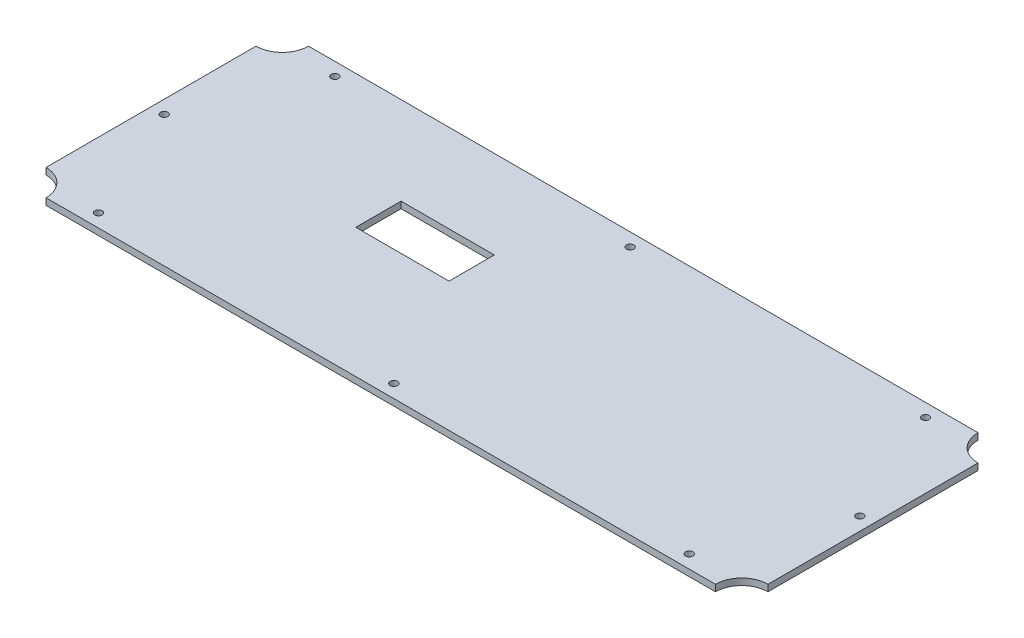
ISO-10303-21;
HEADER;
FILE_DESCRIPTION(('STEP AP214'),'2;1');
FILE_NAME('part.step','',(''),(''),'','','');
FILE_SCHEMA(('AUTOMOTIVE_DESIGN { 1 0 10303 214 1 1 1 1 }'));
ENDSEC;
DATA;
#1=APPLICATION_CONTEXT('core data for automotive mechanical design processes');
#2=APPLICATION_PROTOCOL_DEFINITION('international standard','automotive_design',2000,#1);
#3=PRODUCT_CONTEXT('',#1,'mechanical');
#4=PRODUCT('Part','Part','',(#3));
#5=PRODUCT_RELATED_PRODUCT_CATEGORY('part','',(#4));
#6=PRODUCT_DEFINITION_FORMATION('','',#4);
#7=PRODUCT_DEFINITION_CONTEXT('part definition',#1,'design');
#8=PRODUCT_DEFINITION('design','',#6,#7);
#9=PRODUCT_DEFINITION_SHAPE('','',#8);
#10=(LENGTH_UNIT() NAMED_UNIT(*) SI_UNIT(.MILLI.,.METRE.));
#11=(NAMED_UNIT(*) PLANE_ANGLE_UNIT() SI_UNIT($,.RADIAN.));
#12=(NAMED_UNIT(*) SI_UNIT($,.STERADIAN.) SOLID_ANGLE_UNIT());
#13=UNCERTAINTY_MEASURE_WITH_UNIT(LENGTH_MEASURE(1.E-05),#10,'distance_accuracy_value','');
#14=(GEOMETRIC_REPRESENTATION_CONTEXT(3) GLOBAL_UNCERTAINTY_ASSIGNED_CONTEXT((#13)) GLOBAL_UNIT_ASSIGNED_CONTEXT((#10,
#11,#12)) REPRESENTATION_CONTEXT('',''));
#15=CARTESIAN_POINT('',(0.,0.,0.));
#16=DIRECTION('',(0.,0.,1.));
#17=DIRECTION('',(1.,0.,0.));
#18=AXIS2_PLACEMENT_3D('',#15,#16,#17);
#19=CARTESIAN_POINT('',(-139.7,-5.08,-50.8));
#20=DIRECTION('',(-1.,0.,0.));
#21=DIRECTION('',(0.,0.,1.));
#22=AXIS2_PLACEMENT_3D('',#19,#20,#21);
#23=PLANE('',#22);
#24=DIRECTION('',(0.,1.,0.));
#25=VECTOR('',#24,1.);
#26=CARTESIAN_POINT('',(-139.7,-7.62,-40.64));
#27=LINE('',#26,#25);
#28=CARTESIAN_POINT('',(-139.7,0.,-40.64));
#29=VERTEX_POINT('',#28);
#30=CARTESIAN_POINT('',(-139.7,-2.54,-40.64));
#31=VERTEX_POINT('',#30);
#32=EDGE_CURVE('E159',#29,#31,#27,.F.);
#33=ORIENTED_EDGE('',*,*,#32,.T.);
#34=DIRECTION('',(0.,0.,1.));
#35=VECTOR('',#34,1.);
#36=CARTESIAN_POINT('',(-139.7,-2.54,-50.8));
#37=LINE('',#36,#35);
#38=CARTESIAN_POINT('',(-139.7,-2.54,40.64));
#39=VERTEX_POINT('',#38);
#40=EDGE_CURVE('E55',#31,#39,#37,.T.);
#41=ORIENTED_EDGE('',*,*,#40,.T.);
#42=DIRECTION('',(0.,1.,0.));
#43=VECTOR('',#42,1.);
#44=CARTESIAN_POINT('',(-139.7,-7.62,40.64));
#45=LINE('',#44,#43);
#46=CARTESIAN_POINT('',(-139.7,0.,40.64));
#47=VERTEX_POINT('',#46);
#48=EDGE_CURVE('E182',#47,#39,#45,.F.);
#49=ORIENTED_EDGE('',*,*,#48,.F.);
#50=DIRECTION('',(0.,0.,1.));
#51=VECTOR('',#50,1.);
#52=CARTESIAN_POINT('',(-139.7,0.,-50.8));
#53=LINE('',#52,#51);
#54=EDGE_CURVE('E185',#29,#47,#53,.T.);
#55=ORIENTED_EDGE('',*,*,#54,.F.);
#56=EDGE_LOOP('',(#33,#41,#49,#55));
#57=FACE_BOUND('',#56,.T.);
#58=ADVANCED_FACE('F41',(#57),#23,.T.);
#59=CARTESIAN_POINT('',(139.7,-5.08,-50.8));
#60=DIRECTION('',(0.,0.,-1.));
#61=DIRECTION('',(-1.,0.,0.));
#62=AXIS2_PLACEMENT_3D('',#59,#60,#61);
#63=PLANE('',#62);
#64=DIRECTION('',(0.,1.,0.));
#65=VECTOR('',#64,1.);
#66=CARTESIAN_POINT('',(129.54,-7.62,-50.8));
#67=LINE('',#66,#65);
#68=CARTESIAN_POINT('',(129.54,-2.54,-50.8));
#69=VERTEX_POINT('',#68);
#70=CARTESIAN_POINT('',(129.54,0.,-50.8));
#71=VERTEX_POINT('',#70);
#72=EDGE_CURVE('E164',#69,#71,#67,.T.);
#73=ORIENTED_EDGE('',*,*,#72,.F.);
#74=DIRECTION('',(-1.,0.,0.));
#75=VECTOR('',#74,1.);
#76=CARTESIAN_POINT('',(139.7,-2.54,-50.8));
#77=LINE('',#76,#75);
#78=CARTESIAN_POINT('',(-129.54,-2.54,-50.8));
#79=VERTEX_POINT('',#78);
#80=EDGE_CURVE('E204',#69,#79,#77,.T.);
#81=ORIENTED_EDGE('',*,*,#80,.T.);
#82=DIRECTION('',(0.,1.,0.));
#83=VECTOR('',#82,1.);
#84=CARTESIAN_POINT('',(-129.54,-7.62,-50.8));
#85=LINE('',#84,#83);
#86=CARTESIAN_POINT('',(-129.54,0.,-50.8));
#87=VERTEX_POINT('',#86);
#88=EDGE_CURVE('E157',#79,#87,#85,.T.);
#89=ORIENTED_EDGE('',*,*,#88,.T.);
#90=DIRECTION('',(-1.,0.,0.));
#91=VECTOR('',#90,1.);
#92=CARTESIAN_POINT('',(139.7,0.,-50.8));
#93=LINE('',#92,#91);
#94=EDGE_CURVE('E48',#71,#87,#93,.T.);
#95=ORIENTED_EDGE('',*,*,#94,.F.);
#96=EDGE_LOOP('',(#73,#81,#89,#95));
#97=FACE_BOUND('',#96,.T.);
#98=ADVANCED_FACE('F201',(#97),#63,.T.);
#99=CARTESIAN_POINT('',(139.7,-5.08,-50.8));
#100=DIRECTION('',(1.,0.,0.));
#101=DIRECTION('',(0.,0.,-1.));
#102=AXIS2_PLACEMENT_3D('',#99,#100,#101);
#103=PLANE('',#102);
#104=DIRECTION('',(0.,1.,0.));
#105=VECTOR('',#104,1.);
#106=CARTESIAN_POINT('',(139.7,-7.62,40.64));
#107=LINE('',#106,#105);
#108=CARTESIAN_POINT('',(139.7,0.,40.64));
#109=VERTEX_POINT('',#108);
#110=CARTESIAN_POINT('',(139.7,-2.54,40.64));
#111=VERTEX_POINT('',#110);
#112=EDGE_CURVE('E174',#109,#111,#107,.F.);
#113=ORIENTED_EDGE('',*,*,#112,.T.);
#114=DIRECTION('',(0.,0.,-1.));
#115=VECTOR('',#114,1.);
#116=CARTESIAN_POINT('',(139.7,-2.54,-50.8));
#117=LINE('',#116,#115);
#118=CARTESIAN_POINT('',(139.7,-2.54,-40.64));
#119=VERTEX_POINT('',#118);
#120=EDGE_CURVE('E229',#111,#119,#117,.T.);
#121=ORIENTED_EDGE('',*,*,#120,.T.);
#122=DIRECTION('',(0.,1.,0.));
#123=VECTOR('',#122,1.);
#124=CARTESIAN_POINT('',(139.7,-7.62,-40.64));
#125=LINE('',#124,#123);
#126=CARTESIAN_POINT('',(139.7,0.,-40.64));
#127=VERTEX_POINT('',#126);
#128=EDGE_CURVE('E166',#127,#119,#125,.F.);
#129=ORIENTED_EDGE('',*,*,#128,.F.);
#130=DIRECTION('',(0.,0.,-1.));
#131=VECTOR('',#130,1.);
#132=CARTESIAN_POINT('',(139.7,0.,-50.8));
#133=LINE('',#132,#131);
#134=EDGE_CURVE('E190',#109,#127,#133,.T.);
#135=ORIENTED_EDGE('',*,*,#134,.F.);
#136=EDGE_LOOP('',(#113,#121,#129,#135));
#137=FACE_BOUND('',#136,.T.);
#138=ADVANCED_FACE('F227',(#137),#103,.T.);
#139=CARTESIAN_POINT('',(139.7,-5.08,50.8));
#140=DIRECTION('',(0.,0.,1.));
#141=DIRECTION('',(1.,0.,0.));
#142=AXIS2_PLACEMENT_3D('',#139,#140,#141);
#143=PLANE('',#142);
#144=DIRECTION('',(0.,1.,0.));
#145=VECTOR('',#144,1.);
#146=CARTESIAN_POINT('',(-129.54,-7.62,50.8));
#147=LINE('',#146,#145);
#148=CARTESIAN_POINT('',(-129.54,-2.54,50.8));
#149=VERTEX_POINT('',#148);
#150=CARTESIAN_POINT('',(-129.54,0.,50.8));
#151=VERTEX_POINT('',#150);
#152=EDGE_CURVE('E180',#149,#151,#147,.T.);
#153=ORIENTED_EDGE('',*,*,#152,.F.);
#154=DIRECTION('',(1.,0.,0.));
#155=VECTOR('',#154,1.);
#156=CARTESIAN_POINT('',(139.7,-2.54,50.8));
#157=LINE('',#156,#155);
#158=CARTESIAN_POINT('',(129.54,-2.54,50.8));
#159=VERTEX_POINT('',#158);
#160=EDGE_CURVE('E220',#149,#159,#157,.T.);
#161=ORIENTED_EDGE('',*,*,#160,.T.);
#162=DIRECTION('',(0.,1.,0.));
#163=VECTOR('',#162,1.);
#164=CARTESIAN_POINT('',(129.54,-7.62,50.8));
#165=LINE('',#164,#163);
#166=CARTESIAN_POINT('',(129.54,0.,50.8));
#167=VERTEX_POINT('',#166);
#168=EDGE_CURVE('E172',#159,#167,#165,.T.);
#169=ORIENTED_EDGE('',*,*,#168,.T.);
#170=DIRECTION('',(1.,0.,0.));
#171=VECTOR('',#170,1.);
#172=CARTESIAN_POINT('',(139.7,0.,50.8));
#173=LINE('',#172,#171);
#174=EDGE_CURVE('E187',#151,#167,#173,.T.);
#175=ORIENTED_EDGE('',*,*,#174,.F.);
#176=EDGE_LOOP('',(#153,#161,#169,#175));
#177=FACE_BOUND('',#176,.T.);
#178=ADVANCED_FACE('F219',(#177),#143,.T.);
#179=CARTESIAN_POINT('',(-139.7,-7.62,50.8));
#180=DIRECTION('',(0.,1.,0.));
#181=DIRECTION('',(0.,0.,1.));
#182=AXIS2_PLACEMENT_3D('',#179,#180,#181);
#183=CYLINDRICAL_SURFACE('',#182,10.16);
#184=CARTESIAN_POINT('',(-139.7,-2.54,50.8));
#185=DIRECTION('',(0.,-1.,0.));
#186=DIRECTION('',(0.,0.,-1.));
#187=AXIS2_PLACEMENT_3D('',#184,#185,#186);
#188=CIRCLE('',#187,10.16);
#189=EDGE_CURVE('E216',#149,#39,#188,.F.);
#190=ORIENTED_EDGE('',*,*,#189,.F.);
#191=ORIENTED_EDGE('',*,*,#152,.T.);
#192=CARTESIAN_POINT('',(-139.7,0.,50.8));
#193=DIRECTION('',(0.,1.,0.));
#194=DIRECTION('',(0.,0.,1.));
#195=AXIS2_PLACEMENT_3D('',#192,#193,#194);
#196=CIRCLE('',#195,10.16);
#197=EDGE_CURVE('E177',#151,#47,#196,.T.);
#198=ORIENTED_EDGE('',*,*,#197,.T.);
#199=ORIENTED_EDGE('',*,*,#48,.T.);
#200=EDGE_LOOP('',(#190,#191,#198,#199));
#201=FACE_BOUND('',#200,.T.);
#202=ADVANCED_FACE('F214',(#201),#183,.F.);
#203=CARTESIAN_POINT('',(139.7,-7.62,50.8));
#204=DIRECTION('',(0.,1.,0.));
#205=DIRECTION('',(0.,0.,1.));
#206=AXIS2_PLACEMENT_3D('',#203,#204,#205);
#207=CYLINDRICAL_SURFACE('',#206,10.16);
#208=ORIENTED_EDGE('',*,*,#168,.F.);
#209=CARTESIAN_POINT('',(139.7,-2.54,50.8));
#210=DIRECTION('',(0.,-1.,0.));
#211=DIRECTION('',(0.,0.,-1.));
#212=AXIS2_PLACEMENT_3D('',#209,#210,#211);
#213=CIRCLE('',#212,10.16);
#214=EDGE_CURVE('E241',#159,#111,#213,.T.);
#215=ORIENTED_EDGE('',*,*,#214,.T.);
#216=ORIENTED_EDGE('',*,*,#112,.F.);
#217=CARTESIAN_POINT('',(139.7,0.,50.8));
#218=DIRECTION('',(0.,-1.,0.));
#219=DIRECTION('',(0.,0.,1.));
#220=AXIS2_PLACEMENT_3D('',#217,#218,#219);
#221=CIRCLE('',#220,10.16);
#222=EDGE_CURVE('E169',#167,#109,#221,.T.);
#223=ORIENTED_EDGE('',*,*,#222,.F.);
#224=EDGE_LOOP('',(#208,#215,#216,#223));
#225=FACE_BOUND('',#224,.T.);
#226=ADVANCED_FACE('F286',(#225),#207,.F.);
#227=CARTESIAN_POINT('',(139.7,-7.62,-50.8));
#228=DIRECTION('',(0.,1.,0.));
#229=DIRECTION('',(0.,0.,1.));
#230=AXIS2_PLACEMENT_3D('',#227,#228,#229);
#231=CYLINDRICAL_SURFACE('',#230,10.16);
#232=CARTESIAN_POINT('',(139.7,-2.54,-50.8));
#233=DIRECTION('',(0.,-1.,0.));
#234=DIRECTION('',(0.,0.,-1.));
#235=AXIS2_PLACEMENT_3D('',#232,#233,#234);
#236=CIRCLE('',#235,10.16);
#237=EDGE_CURVE('E233',#69,#119,#236,.F.);
#238=ORIENTED_EDGE('',*,*,#237,.F.);
#239=ORIENTED_EDGE('',*,*,#72,.T.);
#240=CARTESIAN_POINT('',(139.7,0.,-50.8));
#241=DIRECTION('',(0.,1.,0.));
#242=DIRECTION('',(0.,0.,-1.));
#243=AXIS2_PLACEMENT_3D('',#240,#241,#242);
#244=CIRCLE('',#243,10.16);
#245=EDGE_CURVE('E162',#71,#127,#244,.T.);
#246=ORIENTED_EDGE('',*,*,#245,.T.);
#247=ORIENTED_EDGE('',*,*,#128,.T.);
#248=EDGE_LOOP('',(#238,#239,#246,#247));
#249=FACE_BOUND('',#248,.T.);
#250=ADVANCED_FACE('F232',(#249),#231,.F.);
#251=CARTESIAN_POINT('',(-139.7,-7.62,-50.8));
#252=DIRECTION('',(0.,1.,0.));
#253=DIRECTION('',(0.,0.,1.));
#254=AXIS2_PLACEMENT_3D('',#251,#252,#253);
#255=CYLINDRICAL_SURFACE('',#254,10.16);
#256=ORIENTED_EDGE('',*,*,#88,.F.);
#257=CARTESIAN_POINT('',(-139.7,-2.54,-50.8));
#258=DIRECTION('',(0.,-1.,0.));
#259=DIRECTION('',(0.,0.,-1.));
#260=AXIS2_PLACEMENT_3D('',#257,#258,#259);
#261=CIRCLE('',#260,10.16);
#262=EDGE_CURVE('E207',#79,#31,#261,.T.);
#263=ORIENTED_EDGE('',*,*,#262,.T.);
#264=ORIENTED_EDGE('',*,*,#32,.F.);
#265=CARTESIAN_POINT('',(-139.7,0.,-50.8));
#266=DIRECTION('',(0.,-1.,0.));
#267=DIRECTION('',(0.,0.,-1.));
#268=AXIS2_PLACEMENT_3D('',#265,#266,#267);
#269=CIRCLE('',#268,10.16);
#270=EDGE_CURVE('E154',#87,#29,#269,.T.);
#271=ORIENTED_EDGE('',*,*,#270,.F.);
#272=EDGE_LOOP('',(#256,#263,#264,#271));
#273=FACE_BOUND('',#272,.T.);
#274=ADVANCED_FACE('F206',(#273),#255,.F.);
#275=CARTESIAN_POINT('',(-59.69,-7.62,-16.764));
#276=DIRECTION('',(-1.,0.,0.));
#277=DIRECTION('',(0.,0.,1.));
#278=AXIS2_PLACEMENT_3D('',#275,#276,#277);
#279=PLANE('',#278);
#280=DIRECTION('',(0.,0.,1.));
#281=VECTOR('',#280,1.);
#282=CARTESIAN_POINT('',(-59.69,-2.54,-16.764));
#283=LINE('',#282,#281);
#284=CARTESIAN_POINT('',(-59.69,-2.54,-16.764));
#285=VERTEX_POINT('',#284);
#286=CARTESIAN_POINT('',(-59.69,-2.54,0.761999999999968));
#287=VERTEX_POINT('',#286);
#288=EDGE_CURVE('E62',#285,#287,#283,.T.);
#289=ORIENTED_EDGE('',*,*,#288,.F.);
#290=DIRECTION('',(0.,1.,0.));
#291=VECTOR('',#290,1.);
#292=CARTESIAN_POINT('',(-59.69,-7.62,-16.764));
#293=LINE('',#292,#291);
#294=CARTESIAN_POINT('',(-59.69,0.,-16.764));
#295=VERTEX_POINT('',#294);
#296=EDGE_CURVE('E148',#285,#295,#293,.T.);
#297=ORIENTED_EDGE('',*,*,#296,.T.);
#298=DIRECTION('',(0.,0.,1.));
#299=VECTOR('',#298,1.);
#300=CARTESIAN_POINT('',(-59.69,0.,-16.764));
#301=LINE('',#300,#299);
#302=CARTESIAN_POINT('',(-59.69,0.,0.761999999999968));
#303=VERTEX_POINT('',#302);
#304=EDGE_CURVE('E244',#295,#303,#301,.T.);
#305=ORIENTED_EDGE('',*,*,#304,.T.);
#306=DIRECTION('',(0.,1.,0.));
#307=VECTOR('',#306,1.);
#308=CARTESIAN_POINT('',(-59.69,-7.62,0.761999999999968));
#309=LINE('',#308,#307);
#310=EDGE_CURVE('E146',#287,#303,#309,.T.);
#311=ORIENTED_EDGE('',*,*,#310,.F.);
#312=EDGE_LOOP('',(#289,#297,#305,#311));
#313=FACE_BOUND('',#312,.T.);
#314=ADVANCED_FACE('F253',(#313),#279,.F.);
#315=CARTESIAN_POINT('',(-59.69,-7.62,-16.764));
#316=DIRECTION('',(0.,0.,-1.));
#317=DIRECTION('',(-1.,0.,0.));
#318=AXIS2_PLACEMENT_3D('',#315,#316,#317);
#319=PLANE('',#318);
#320=DIRECTION('',(-1.,0.,0.));
#321=VECTOR('',#320,1.);
#322=CARTESIAN_POINT('',(-59.69,-2.54,-16.764));
#323=LINE('',#322,#321);
#324=CARTESIAN_POINT('',(-23.622,-2.54,-16.764));
#325=VERTEX_POINT('',#324);
#326=EDGE_CURVE('E139',#325,#285,#323,.T.);
#327=ORIENTED_EDGE('',*,*,#326,.F.);
#328=DIRECTION('',(0.,1.,0.));
#329=VECTOR('',#328,1.);
#330=CARTESIAN_POINT('',(-23.622,-7.62,-16.764));
#331=LINE('',#330,#329);
#332=CARTESIAN_POINT('',(-23.622,0.,-16.764));
#333=VERTEX_POINT('',#332);
#334=EDGE_CURVE('E138',#325,#333,#331,.T.);
#335=ORIENTED_EDGE('',*,*,#334,.T.);
#336=DIRECTION('',(-1.,0.,0.));
#337=VECTOR('',#336,1.);
#338=CARTESIAN_POINT('',(-59.69,0.,-16.764));
#339=LINE('',#338,#337);
#340=EDGE_CURVE('E150',#333,#295,#339,.T.);
#341=ORIENTED_EDGE('',*,*,#340,.T.);
#342=ORIENTED_EDGE('',*,*,#296,.F.);
#343=EDGE_LOOP('',(#327,#335,#341,#342));
#344=FACE_BOUND('',#343,.T.);
#345=ADVANCED_FACE('F257',(#344),#319,.F.);
#346=CARTESIAN_POINT('',(-23.622,-7.62,-16.764));
#347=DIRECTION('',(1.,0.,0.));
#348=DIRECTION('',(0.,0.,-1.));
#349=AXIS2_PLACEMENT_3D('',#346,#347,#348);
#350=PLANE('',#349);
#351=DIRECTION('',(0.,0.,-1.));
#352=VECTOR('',#351,1.);
#353=CARTESIAN_POINT('',(-23.622,-2.54,-16.764));
#354=LINE('',#353,#352);
#355=CARTESIAN_POINT('',(-23.622,-2.54,0.761999999999961));
#356=VERTEX_POINT('',#355);
#357=EDGE_CURVE('E127',#356,#325,#354,.T.);
#358=ORIENTED_EDGE('',*,*,#357,.F.);
#359=DIRECTION('',(0.,1.,0.));
#360=VECTOR('',#359,1.);
#361=CARTESIAN_POINT('',(-23.622,-7.62,0.761999999999961));
#362=LINE('',#361,#360);
#363=CARTESIAN_POINT('',(-23.622,0.,0.761999999999961));
#364=VERTEX_POINT('',#363);
#365=EDGE_CURVE('E136',#356,#364,#362,.T.);
#366=ORIENTED_EDGE('',*,*,#365,.T.);
#367=DIRECTION('',(0.,0.,-1.));
#368=VECTOR('',#367,1.);
#369=CARTESIAN_POINT('',(-23.622,0.,-16.764));
#370=LINE('',#369,#368);
#371=EDGE_CURVE('E248',#364,#333,#370,.T.);
#372=ORIENTED_EDGE('',*,*,#371,.T.);
#373=ORIENTED_EDGE('',*,*,#334,.F.);
#374=EDGE_LOOP('',(#358,#366,#372,#373));
#375=FACE_BOUND('',#374,.T.);
#376=ADVANCED_FACE('F134',(#375),#350,.F.);
#377=CARTESIAN_POINT('',(-59.69,-7.62,0.761999999999968));
#378=DIRECTION('',(0.,0.,1.));
#379=DIRECTION('',(1.,0.,0.));
#380=AXIS2_PLACEMENT_3D('',#377,#378,#379);
#381=PLANE('',#380);
#382=DIRECTION('',(1.,0.,0.));
#383=VECTOR('',#382,1.);
#384=CARTESIAN_POINT('',(-59.69,-2.54,0.761999999999968));
#385=LINE('',#384,#383);
#386=EDGE_CURVE('E11',#287,#356,#385,.T.);
#387=ORIENTED_EDGE('',*,*,#386,.F.);
#388=ORIENTED_EDGE('',*,*,#310,.T.);
#389=DIRECTION('',(1.,0.,0.));
#390=VECTOR('',#389,1.);
#391=CARTESIAN_POINT('',(-59.69,0.,0.761999999999968));
#392=LINE('',#391,#390);
#393=EDGE_CURVE('E144',#303,#364,#392,.T.);
#394=ORIENTED_EDGE('',*,*,#393,.T.);
#395=ORIENTED_EDGE('',*,*,#365,.F.);
#396=EDGE_LOOP('',(#387,#388,#394,#395));
#397=FACE_BOUND('',#396,.T.);
#398=ADVANCED_FACE('F142',(#397),#381,.F.);
#399=CARTESIAN_POINT('',(0.,0.,0.));
#400=DIRECTION('',(0.,-1.,0.));
#401=DIRECTION('',(0.,0.,-1.));
#402=AXIS2_PLACEMENT_3D('',#399,#400,#401);
#403=PLANE('',#402);
#404=CARTESIAN_POINT('',(0.,0.,45.72));
#405=DIRECTION('',(0.,1.,0.));
#406=DIRECTION('',(0.,0.,1.));
#407=AXIS2_PLACEMENT_3D('',#404,#405,#406);
#408=CIRCLE('',#407,1.4224);
#409=CARTESIAN_POINT('',(0.,0.,47.1424));
#410=VERTEX_POINT('',#409);
#411=EDGE_CURVE('E336',#410,#410,#408,.T.);
#412=ORIENTED_EDGE('',*,*,#411,.F.);
#413=EDGE_LOOP('',(#412));
#414=FACE_BOUND('',#413,.T.);
#415=CARTESIAN_POINT('',(0.,0.,-45.72));
#416=DIRECTION('',(0.,-1.,0.));
#417=DIRECTION('',(0.,0.,-1.));
#418=AXIS2_PLACEMENT_3D('',#415,#416,#417);
#419=CIRCLE('',#418,1.4224);
#420=CARTESIAN_POINT('',(0.,0.,-47.1424));
#421=VERTEX_POINT('',#420);
#422=EDGE_CURVE('E344',#421,#421,#419,.T.);
#423=ORIENTED_EDGE('',*,*,#422,.T.);
#424=EDGE_LOOP('',(#423));
#425=FACE_BOUND('',#424,.T.);
#426=CARTESIAN_POINT('',(134.62,0.,0.));
#427=DIRECTION('',(0.,1.,0.));
#428=DIRECTION('',(0.,0.,-1.));
#429=AXIS2_PLACEMENT_3D('',#426,#427,#428);
#430=CIRCLE('',#429,1.42239999999999);
#431=CARTESIAN_POINT('',(134.62,0.,-1.42240000000002));
#432=VERTEX_POINT('',#431);
#433=EDGE_CURVE('E350',#432,#432,#430,.T.);
#434=ORIENTED_EDGE('',*,*,#433,.F.);
#435=EDGE_LOOP('',(#434));
#436=FACE_BOUND('',#435,.T.);
#437=CARTESIAN_POINT('',(-134.62,0.,0.));
#438=DIRECTION('',(0.,-1.,0.));
#439=DIRECTION('',(0.,0.,-1.));
#440=AXIS2_PLACEMENT_3D('',#437,#438,#439);
#441=CIRCLE('',#440,1.42239999999999);
#442=CARTESIAN_POINT('',(-134.62,0.,-1.42240000000002));
#443=VERTEX_POINT('',#442);
#444=EDGE_CURVE('E356',#443,#443,#441,.T.);
#445=ORIENTED_EDGE('',*,*,#444,.T.);
#446=EDGE_LOOP('',(#445));
#447=FACE_BOUND('',#446,.T.);
#448=CARTESIAN_POINT('',(114.3,0.,45.72));
#449=DIRECTION('',(0.,-1.,0.));
#450=DIRECTION('',(0.,0.,1.));
#451=AXIS2_PLACEMENT_3D('',#448,#449,#450);
#452=CIRCLE('',#451,1.42240000000001);
#453=CARTESIAN_POINT('',(114.3,0.,47.1424));
#454=VERTEX_POINT('',#453);
#455=EDGE_CURVE('E362',#454,#454,#452,.T.);
#456=ORIENTED_EDGE('',*,*,#455,.T.);
#457=EDGE_LOOP('',(#456));
#458=FACE_BOUND('',#457,.T.);
#459=CARTESIAN_POINT('',(-114.3,0.,45.72));
#460=DIRECTION('',(0.,1.,0.));
#461=DIRECTION('',(0.,0.,1.));
#462=AXIS2_PLACEMENT_3D('',#459,#460,#461);
#463=CIRCLE('',#462,1.42240000000001);
#464=CARTESIAN_POINT('',(-114.3,0.,47.1424));
#465=VERTEX_POINT('',#464);
#466=EDGE_CURVE('E368',#465,#465,#463,.T.);
#467=ORIENTED_EDGE('',*,*,#466,.F.);
#468=EDGE_LOOP('',(#467));
#469=FACE_BOUND('',#468,.T.);
#470=CARTESIAN_POINT('',(114.3,0.,-45.72));
#471=DIRECTION('',(0.,1.,0.));
#472=DIRECTION('',(0.,0.,-1.));
#473=AXIS2_PLACEMENT_3D('',#470,#471,#472);
#474=CIRCLE('',#473,1.42240000000001);
#475=CARTESIAN_POINT('',(114.3,0.,-47.1424));
#476=VERTEX_POINT('',#475);
#477=EDGE_CURVE('E374',#476,#476,#474,.T.);
#478=ORIENTED_EDGE('',*,*,#477,.F.);
#479=EDGE_LOOP('',(#478));
#480=FACE_BOUND('',#479,.T.);
#481=CARTESIAN_POINT('',(-114.3,0.,-45.72));
#482=DIRECTION('',(0.,-1.,0.));
#483=DIRECTION('',(0.,0.,-1.));
#484=AXIS2_PLACEMENT_3D('',#481,#482,#483);
#485=CIRCLE('',#484,1.42240000000001);
#486=CARTESIAN_POINT('',(-114.3,0.,-47.1424));
#487=VERTEX_POINT('',#486);
#488=EDGE_CURVE('E140',#487,#487,#485,.T.);
#489=ORIENTED_EDGE('',*,*,#488,.T.);
#490=EDGE_LOOP('',(#489));
#491=FACE_BOUND('',#490,.T.);
#492=ORIENTED_EDGE('',*,*,#393,.F.);
#493=ORIENTED_EDGE('',*,*,#304,.F.);
#494=ORIENTED_EDGE('',*,*,#340,.F.);
#495=ORIENTED_EDGE('',*,*,#371,.F.);
#496=EDGE_LOOP('',(#492,#493,#494,#495));
#497=FACE_BOUND('',#496,.T.);
#498=ORIENTED_EDGE('',*,*,#270,.T.);
#499=ORIENTED_EDGE('',*,*,#54,.T.);
#500=ORIENTED_EDGE('',*,*,#197,.F.);
#501=ORIENTED_EDGE('',*,*,#174,.T.);
#502=ORIENTED_EDGE('',*,*,#222,.T.);
#503=ORIENTED_EDGE('',*,*,#134,.T.);
#504=ORIENTED_EDGE('',*,*,#245,.F.);
#505=ORIENTED_EDGE('',*,*,#94,.T.);
#506=EDGE_LOOP('',(#498,#499,#500,#501,#502,#503,#504,#505));
#507=FACE_BOUND('',#506,.T.);
#508=ADVANCED_FACE('F196',(#414,#425,#436,#447,#458,#469,#480,#491,#497,#507),#403,.F.);
#509=CARTESIAN_POINT('',(0.,-2.54,0.));
#510=DIRECTION('',(0.,-1.,0.));
#511=DIRECTION('',(0.,0.,-1.));
#512=AXIS2_PLACEMENT_3D('',#509,#510,#511);
#513=PLANE('',#512);
#514=CARTESIAN_POINT('',(0.,-2.54,45.72));
#515=DIRECTION('',(0.,1.,0.));
#516=DIRECTION('',(0.,0.,1.));
#517=AXIS2_PLACEMENT_3D('',#514,#515,#516);
#518=CIRCLE('',#517,1.4224);
#519=CARTESIAN_POINT('',(0.,-2.54,47.1424));
#520=VERTEX_POINT('',#519);
#521=EDGE_CURVE('E339',#520,#520,#518,.T.);
#522=ORIENTED_EDGE('',*,*,#521,.T.);
#523=EDGE_LOOP('',(#522));
#524=FACE_BOUND('',#523,.T.);
#525=CARTESIAN_POINT('',(0.,-2.54,-45.72));
#526=DIRECTION('',(0.,-1.,0.));
#527=DIRECTION('',(0.,0.,-1.));
#528=AXIS2_PLACEMENT_3D('',#525,#526,#527);
#529=CIRCLE('',#528,1.4224);
#530=CARTESIAN_POINT('',(0.,-2.54,-47.1424));
#531=VERTEX_POINT('',#530);
#532=EDGE_CURVE('E341',#531,#531,#529,.T.);
#533=ORIENTED_EDGE('',*,*,#532,.F.);
#534=EDGE_LOOP('',(#533));
#535=FACE_BOUND('',#534,.T.);
#536=CARTESIAN_POINT('',(134.62,-2.54,0.));
#537=DIRECTION('',(0.,1.,0.));
#538=DIRECTION('',(0.,0.,-1.));
#539=AXIS2_PLACEMENT_3D('',#536,#537,#538);
#540=CIRCLE('',#539,1.42239999999999);
#541=CARTESIAN_POINT('',(134.62,-2.54,-1.42240000000002));
#542=VERTEX_POINT('',#541);
#543=EDGE_CURVE('E347',#542,#542,#540,.T.);
#544=ORIENTED_EDGE('',*,*,#543,.T.);
#545=EDGE_LOOP('',(#544));
#546=FACE_BOUND('',#545,.T.);
#547=CARTESIAN_POINT('',(-134.62,-2.54,0.));
#548=DIRECTION('',(0.,-1.,0.));
#549=DIRECTION('',(0.,0.,-1.));
#550=AXIS2_PLACEMENT_3D('',#547,#548,#549);
#551=CIRCLE('',#550,1.42239999999999);
#552=CARTESIAN_POINT('',(-134.62,-2.54,-1.42240000000002));
#553=VERTEX_POINT('',#552);
#554=EDGE_CURVE('E353',#553,#553,#551,.T.);
#555=ORIENTED_EDGE('',*,*,#554,.F.);
#556=EDGE_LOOP('',(#555));
#557=FACE_BOUND('',#556,.T.);
#558=CARTESIAN_POINT('',(114.3,-2.54,45.72));
#559=DIRECTION('',(0.,-1.,0.));
#560=DIRECTION('',(0.,0.,1.));
#561=AXIS2_PLACEMENT_3D('',#558,#559,#560);
#562=CIRCLE('',#561,1.42240000000001);
#563=CARTESIAN_POINT('',(114.3,-2.54,47.1424));
#564=VERTEX_POINT('',#563);
#565=EDGE_CURVE('E359',#564,#564,#562,.T.);
#566=ORIENTED_EDGE('',*,*,#565,.F.);
#567=EDGE_LOOP('',(#566));
#568=FACE_BOUND('',#567,.T.);
#569=CARTESIAN_POINT('',(-114.3,-2.54,45.72));
#570=DIRECTION('',(0.,1.,0.));
#571=DIRECTION('',(0.,0.,1.));
#572=AXIS2_PLACEMENT_3D('',#569,#570,#571);
#573=CIRCLE('',#572,1.42240000000001);
#574=CARTESIAN_POINT('',(-114.3,-2.54,47.1424));
#575=VERTEX_POINT('',#574);
#576=EDGE_CURVE('E365',#575,#575,#573,.T.);
#577=ORIENTED_EDGE('',*,*,#576,.T.);
#578=EDGE_LOOP('',(#577));
#579=FACE_BOUND('',#578,.T.);
#580=CARTESIAN_POINT('',(114.3,-2.54,-45.72));
#581=DIRECTION('',(0.,1.,0.));
#582=DIRECTION('',(0.,0.,-1.));
#583=AXIS2_PLACEMENT_3D('',#580,#581,#582);
#584=CIRCLE('',#583,1.42240000000001);
#585=CARTESIAN_POINT('',(114.3,-2.54,-47.1424));
#586=VERTEX_POINT('',#585);
#587=EDGE_CURVE('E371',#586,#586,#584,.T.);
#588=ORIENTED_EDGE('',*,*,#587,.T.);
#589=EDGE_LOOP('',(#588));
#590=FACE_BOUND('',#589,.T.);
#591=CARTESIAN_POINT('',(-114.3,-2.54,-45.72));
#592=DIRECTION('',(0.,-1.,0.));
#593=DIRECTION('',(0.,0.,-1.));
#594=AXIS2_PLACEMENT_3D('',#591,#592,#593);
#595=CIRCLE('',#594,1.42240000000001);
#596=CARTESIAN_POINT('',(-114.3,-2.54,-47.1424));
#597=VERTEX_POINT('',#596);
#598=EDGE_CURVE('E377',#597,#597,#595,.T.);
#599=ORIENTED_EDGE('',*,*,#598,.F.);
#600=EDGE_LOOP('',(#599));
#601=FACE_BOUND('',#600,.T.);
#602=ORIENTED_EDGE('',*,*,#160,.F.);
#603=ORIENTED_EDGE('',*,*,#189,.T.);
#604=ORIENTED_EDGE('',*,*,#40,.F.);
#605=ORIENTED_EDGE('',*,*,#262,.F.);
#606=ORIENTED_EDGE('',*,*,#80,.F.);
#607=ORIENTED_EDGE('',*,*,#237,.T.);
#608=ORIENTED_EDGE('',*,*,#120,.F.);
#609=ORIENTED_EDGE('',*,*,#214,.F.);
#610=EDGE_LOOP('',(#602,#603,#604,#605,#606,#607,#608,#609));
#611=FACE_BOUND('',#610,.T.);
#612=ORIENTED_EDGE('',*,*,#288,.T.);
#613=ORIENTED_EDGE('',*,*,#386,.T.);
#614=ORIENTED_EDGE('',*,*,#357,.T.);
#615=ORIENTED_EDGE('',*,*,#326,.T.);
#616=EDGE_LOOP('',(#612,#613,#614,#615));
#617=FACE_BOUND('',#616,.T.);
#618=ADVANCED_FACE('F126',(#524,#535,#546,#557,#568,#579,#590,#601,#611,#617),#513,.T.);
#619=CARTESIAN_POINT('',(-114.3,0.,-45.72));
#620=DIRECTION('',(0.,-1.,0.));
#621=DIRECTION('',(0.,0.,-1.));
#622=AXIS2_PLACEMENT_3D('',#619,#620,#621);
#623=CYLINDRICAL_SURFACE('',#622,1.42240000000001);
#624=ORIENTED_EDGE('',*,*,#488,.F.);
#625=EDGE_LOOP('',(#624));
#626=FACE_BOUND('',#625,.T.);
#627=ORIENTED_EDGE('',*,*,#598,.T.);
#628=EDGE_LOOP('',(#627));
#629=FACE_BOUND('',#628,.T.);
#630=ADVANCED_FACE('F266',(#626,#629),#623,.F.);
#631=CARTESIAN_POINT('',(114.3,0.,-45.72));
#632=DIRECTION('',(0.,-1.,0.));
#633=DIRECTION('',(0.,0.,-1.));
#634=AXIS2_PLACEMENT_3D('',#631,#632,#633);
#635=CYLINDRICAL_SURFACE('',#634,1.42240000000001);
#636=ORIENTED_EDGE('',*,*,#477,.T.);
#637=EDGE_LOOP('',(#636));
#638=FACE_BOUND('',#637,.T.);
#639=ORIENTED_EDGE('',*,*,#587,.F.);
#640=EDGE_LOOP('',(#639));
#641=FACE_BOUND('',#640,.T.);
#642=ADVANCED_FACE('F304',(#638,#641),#635,.F.);
#643=CARTESIAN_POINT('',(-114.3,0.,45.72));
#644=DIRECTION('',(0.,-1.,0.));
#645=DIRECTION('',(0.,0.,-1.));
#646=AXIS2_PLACEMENT_3D('',#643,#644,#645);
#647=CYLINDRICAL_SURFACE('',#646,1.42240000000001);
#648=ORIENTED_EDGE('',*,*,#466,.T.);
#649=EDGE_LOOP('',(#648));
#650=FACE_BOUND('',#649,.T.);
#651=ORIENTED_EDGE('',*,*,#576,.F.);
#652=EDGE_LOOP('',(#651));
#653=FACE_BOUND('',#652,.T.);
#654=ADVANCED_FACE('F308',(#650,#653),#647,.F.);
#655=CARTESIAN_POINT('',(114.3,0.,45.72));
#656=DIRECTION('',(0.,-1.,0.));
#657=DIRECTION('',(0.,0.,-1.));
#658=AXIS2_PLACEMENT_3D('',#655,#656,#657);
#659=CYLINDRICAL_SURFACE('',#658,1.42240000000001);
#660=ORIENTED_EDGE('',*,*,#455,.F.);
#661=EDGE_LOOP('',(#660));
#662=FACE_BOUND('',#661,.T.);
#663=ORIENTED_EDGE('',*,*,#565,.T.);
#664=EDGE_LOOP('',(#663));
#665=FACE_BOUND('',#664,.T.);
#666=ADVANCED_FACE('F312',(#662,#665),#659,.F.);
#667=CARTESIAN_POINT('',(-134.62,0.,0.));
#668=DIRECTION('',(0.,-1.,0.));
#669=DIRECTION('',(0.,0.,-1.));
#670=AXIS2_PLACEMENT_3D('',#667,#668,#669);
#671=CYLINDRICAL_SURFACE('',#670,1.42239999999999);
#672=ORIENTED_EDGE('',*,*,#444,.F.);
#673=EDGE_LOOP('',(#672));
#674=FACE_BOUND('',#673,.T.);
#675=ORIENTED_EDGE('',*,*,#554,.T.);
#676=EDGE_LOOP('',(#675));
#677=FACE_BOUND('',#676,.T.);
#678=ADVANCED_FACE('F316',(#674,#677),#671,.F.);
#679=CARTESIAN_POINT('',(134.62,0.,0.));
#680=DIRECTION('',(0.,-1.,0.));
#681=DIRECTION('',(0.,0.,-1.));
#682=AXIS2_PLACEMENT_3D('',#679,#680,#681);
#683=CYLINDRICAL_SURFACE('',#682,1.42239999999999);
#684=ORIENTED_EDGE('',*,*,#433,.T.);
#685=EDGE_LOOP('',(#684));
#686=FACE_BOUND('',#685,.T.);
#687=ORIENTED_EDGE('',*,*,#543,.F.);
#688=EDGE_LOOP('',(#687));
#689=FACE_BOUND('',#688,.T.);
#690=ADVANCED_FACE('F320',(#686,#689),#683,.F.);
#691=CARTESIAN_POINT('',(0.,0.,-45.72));
#692=DIRECTION('',(0.,-1.,0.));
#693=DIRECTION('',(0.,0.,-1.));
#694=AXIS2_PLACEMENT_3D('',#691,#692,#693);
#695=CYLINDRICAL_SURFACE('',#694,1.4224);
#696=ORIENTED_EDGE('',*,*,#422,.F.);
#697=EDGE_LOOP('',(#696));
#698=FACE_BOUND('',#697,.T.);
#699=ORIENTED_EDGE('',*,*,#532,.T.);
#700=EDGE_LOOP('',(#699));
#701=FACE_BOUND('',#700,.T.);
#702=ADVANCED_FACE('F324',(#698,#701),#695,.F.);
#703=CARTESIAN_POINT('',(0.,0.,45.72));
#704=DIRECTION('',(0.,-1.,0.));
#705=DIRECTION('',(0.,0.,-1.));
#706=AXIS2_PLACEMENT_3D('',#703,#704,#705);
#707=CYLINDRICAL_SURFACE('',#706,1.4224);
#708=ORIENTED_EDGE('',*,*,#411,.T.);
#709=EDGE_LOOP('',(#708));
#710=FACE_BOUND('',#709,.T.);
#711=ORIENTED_EDGE('',*,*,#521,.F.);
#712=EDGE_LOOP('',(#711));
#713=FACE_BOUND('',#712,.T.);
#714=ADVANCED_FACE('F328',(#710,#713),#707,.F.);
#715=CLOSED_SHELL('',(#58,#98,#138,#178,#202,#226,#250,#274,#314,#345,#376,#398,#508,#618,#630,
#642,#654,#666,#678,#690,#702,#714));
#716=MANIFOLD_SOLID_BREP('B2',#715);
#717=ADVANCED_BREP_SHAPE_REPRESENTATION('',(#18,#716),#14);
#718=SHAPE_DEFINITION_REPRESENTATION(#9,#717);
ENDSEC;
END-ISO-10303-21;
